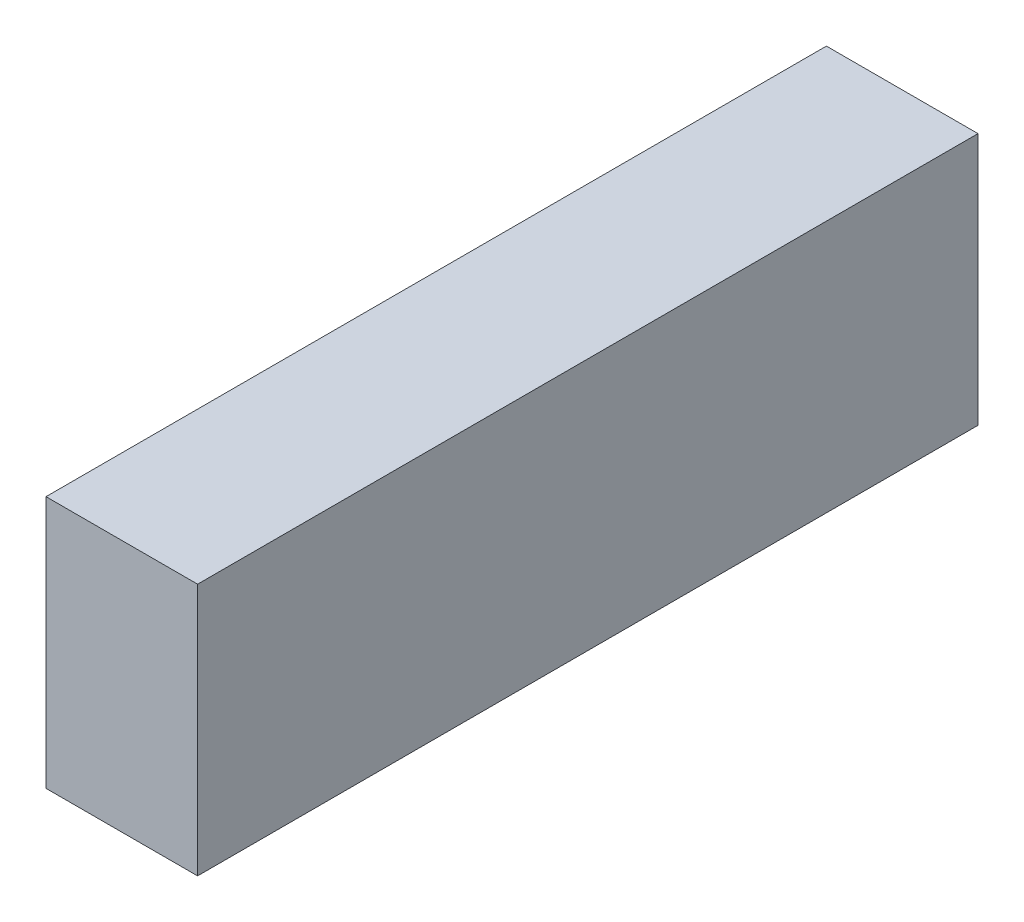
ISO-10303-21;
HEADER;
FILE_DESCRIPTION(('STEP AP214'),'2;1');
FILE_NAME('part.step','',(''),(''),'','','');
FILE_SCHEMA(('AUTOMOTIVE_DESIGN { 1 0 10303 214 1 1 1 1 }'));
ENDSEC;
DATA;
#1=APPLICATION_CONTEXT('core data for automotive mechanical design processes');
#2=APPLICATION_PROTOCOL_DEFINITION('international standard','automotive_design',2000,#1);
#3=PRODUCT_CONTEXT('',#1,'mechanical');
#4=PRODUCT('Part','Part','',(#3));
#5=PRODUCT_RELATED_PRODUCT_CATEGORY('part','',(#4));
#6=PRODUCT_DEFINITION_FORMATION('','',#4);
#7=PRODUCT_DEFINITION_CONTEXT('part definition',#1,'design');
#8=PRODUCT_DEFINITION('design','',#6,#7);
#9=PRODUCT_DEFINITION_SHAPE('','',#8);
#10=(LENGTH_UNIT() NAMED_UNIT(*) SI_UNIT(.MILLI.,.METRE.));
#11=(NAMED_UNIT(*) PLANE_ANGLE_UNIT() SI_UNIT($,.RADIAN.));
#12=(NAMED_UNIT(*) SI_UNIT($,.STERADIAN.) SOLID_ANGLE_UNIT());
#13=UNCERTAINTY_MEASURE_WITH_UNIT(LENGTH_MEASURE(1.E-05),#10,'distance_accuracy_value','');
#14=(GEOMETRIC_REPRESENTATION_CONTEXT(3) GLOBAL_UNCERTAINTY_ASSIGNED_CONTEXT((#13)) GLOBAL_UNIT_ASSIGNED_CONTEXT((#10,
#11,#12)) REPRESENTATION_CONTEXT('',''));
#15=CARTESIAN_POINT('',(0.,0.,0.));
#16=DIRECTION('',(0.,0.,1.));
#17=DIRECTION('',(1.,0.,0.));
#18=AXIS2_PLACEMENT_3D('',#15,#16,#17);
#19=CARTESIAN_POINT('',(-13.5,22.5,69.5));
#20=DIRECTION('',(1.,0.,0.));
#21=DIRECTION('',(0.,1.,0.));
#22=AXIS2_PLACEMENT_3D('',#19,#20,#21);
#23=PLANE('',#22);
#24=DIRECTION('',(0.,-1.,0.));
#25=VECTOR('',#24,1.);
#26=CARTESIAN_POINT('',(-13.5,22.5,-69.5));
#27=LINE('',#26,#25);
#28=CARTESIAN_POINT('',(-13.5,22.5,-69.5));
#29=VERTEX_POINT('',#28);
#30=CARTESIAN_POINT('',(-13.5,-22.5,-69.5));
#31=VERTEX_POINT('',#30);
#32=EDGE_CURVE('E97',#29,#31,#27,.T.);
#33=ORIENTED_EDGE('',*,*,#32,.T.);
#34=DIRECTION('',(0.,0.,-1.));
#35=VECTOR('',#34,1.);
#36=CARTESIAN_POINT('',(-13.5,-22.5,69.5));
#37=LINE('',#36,#35);
#38=CARTESIAN_POINT('',(-13.5,-22.5,69.5));
#39=VERTEX_POINT('',#38);
#40=EDGE_CURVE('E11',#39,#31,#37,.T.);
#41=ORIENTED_EDGE('',*,*,#40,.F.);
#42=DIRECTION('',(0.,-1.,0.));
#43=VECTOR('',#42,1.);
#44=CARTESIAN_POINT('',(-13.5,22.5,69.5));
#45=LINE('',#44,#43);
#46=CARTESIAN_POINT('',(-13.5,22.5,69.5));
#47=VERTEX_POINT('',#46);
#48=EDGE_CURVE('E85',#47,#39,#45,.T.);
#49=ORIENTED_EDGE('',*,*,#48,.F.);
#50=DIRECTION('',(0.,0.,-1.));
#51=VECTOR('',#50,1.);
#52=CARTESIAN_POINT('',(-13.5,22.5,69.5));
#53=LINE('',#52,#51);
#54=EDGE_CURVE('E93',#47,#29,#53,.T.);
#55=ORIENTED_EDGE('',*,*,#54,.T.);
#56=EDGE_LOOP('',(#33,#41,#49,#55));
#57=FACE_BOUND('',#56,.T.);
#58=ADVANCED_FACE('F34',(#57),#23,.F.);
#59=CARTESIAN_POINT('',(13.5,-22.5,69.5));
#60=DIRECTION('',(0.,1.,0.));
#61=DIRECTION('',(-1.,0.,0.));
#62=AXIS2_PLACEMENT_3D('',#59,#60,#61);
#63=PLANE('',#62);
#64=DIRECTION('',(1.,0.,0.));
#65=VECTOR('',#64,1.);
#66=CARTESIAN_POINT('',(13.5,-22.5,-69.5));
#67=LINE('',#66,#65);
#68=CARTESIAN_POINT('',(13.5,-22.5,-69.5));
#69=VERTEX_POINT('',#68);
#70=EDGE_CURVE('E89',#31,#69,#67,.T.);
#71=ORIENTED_EDGE('',*,*,#70,.T.);
#72=DIRECTION('',(0.,0.,-1.));
#73=VECTOR('',#72,1.);
#74=CARTESIAN_POINT('',(13.5,-22.5,69.5));
#75=LINE('',#74,#73);
#76=CARTESIAN_POINT('',(13.5,-22.5,69.5));
#77=VERTEX_POINT('',#76);
#78=EDGE_CURVE('E42',#77,#69,#75,.T.);
#79=ORIENTED_EDGE('',*,*,#78,.F.);
#80=DIRECTION('',(1.,0.,0.));
#81=VECTOR('',#80,1.);
#82=CARTESIAN_POINT('',(13.5,-22.5,69.5));
#83=LINE('',#82,#81);
#84=EDGE_CURVE('E80',#39,#77,#83,.T.);
#85=ORIENTED_EDGE('',*,*,#84,.F.);
#86=ORIENTED_EDGE('',*,*,#40,.T.);
#87=EDGE_LOOP('',(#71,#79,#85,#86));
#88=FACE_BOUND('',#87,.T.);
#89=ADVANCED_FACE('F88',(#88),#63,.F.);
#90=CARTESIAN_POINT('',(13.5,22.5,69.5));
#91=DIRECTION('',(-1.,0.,0.));
#92=DIRECTION('',(0.,-1.,0.));
#93=AXIS2_PLACEMENT_3D('',#90,#91,#92);
#94=PLANE('',#93);
#95=DIRECTION('',(0.,1.,0.));
#96=VECTOR('',#95,1.);
#97=CARTESIAN_POINT('',(13.5,22.5,-69.5));
#98=LINE('',#97,#96);
#99=CARTESIAN_POINT('',(13.5,22.5,-69.5));
#100=VERTEX_POINT('',#99);
#101=EDGE_CURVE('E67',#69,#100,#98,.T.);
#102=ORIENTED_EDGE('',*,*,#101,.T.);
#103=DIRECTION('',(0.,0.,-1.));
#104=VECTOR('',#103,1.);
#105=CARTESIAN_POINT('',(13.5,22.5,69.5));
#106=LINE('',#105,#104);
#107=CARTESIAN_POINT('',(13.5,22.5,69.5));
#108=VERTEX_POINT('',#107);
#109=EDGE_CURVE('E90',#108,#100,#106,.T.);
#110=ORIENTED_EDGE('',*,*,#109,.F.);
#111=DIRECTION('',(0.,1.,0.));
#112=VECTOR('',#111,1.);
#113=CARTESIAN_POINT('',(13.5,22.5,69.5));
#114=LINE('',#113,#112);
#115=EDGE_CURVE('E83',#77,#108,#114,.T.);
#116=ORIENTED_EDGE('',*,*,#115,.F.);
#117=ORIENTED_EDGE('',*,*,#78,.T.);
#118=EDGE_LOOP('',(#102,#110,#116,#117));
#119=FACE_BOUND('',#118,.T.);
#120=ADVANCED_FACE('F91',(#119),#94,.F.);
#121=CARTESIAN_POINT('',(13.5,22.5,69.5));
#122=DIRECTION('',(0.,-1.,0.));
#123=DIRECTION('',(1.,0.,0.));
#124=AXIS2_PLACEMENT_3D('',#121,#122,#123);
#125=PLANE('',#124);
#126=DIRECTION('',(-1.,0.,0.));
#127=VECTOR('',#126,1.);
#128=CARTESIAN_POINT('',(13.5,22.5,-69.5));
#129=LINE('',#128,#127);
#130=EDGE_CURVE('E73',#100,#29,#129,.T.);
#131=ORIENTED_EDGE('',*,*,#130,.T.);
#132=ORIENTED_EDGE('',*,*,#54,.F.);
#133=DIRECTION('',(-1.,0.,0.));
#134=VECTOR('',#133,1.);
#135=CARTESIAN_POINT('',(13.5,22.5,69.5));
#136=LINE('',#135,#134);
#137=EDGE_CURVE('E50',#108,#47,#136,.T.);
#138=ORIENTED_EDGE('',*,*,#137,.F.);
#139=ORIENTED_EDGE('',*,*,#109,.T.);
#140=EDGE_LOOP('',(#131,#132,#138,#139));
#141=FACE_BOUND('',#140,.T.);
#142=ADVANCED_FACE('F104',(#141),#125,.F.);
#143=CARTESIAN_POINT('',(0.,0.,69.5));
#144=DIRECTION('',(0.,0.,-1.));
#145=DIRECTION('',(-1.,0.,0.));
#146=AXIS2_PLACEMENT_3D('',#143,#144,#145);
#147=PLANE('',#146);
#148=ORIENTED_EDGE('',*,*,#48,.T.);
#149=ORIENTED_EDGE('',*,*,#84,.T.);
#150=ORIENTED_EDGE('',*,*,#115,.T.);
#151=ORIENTED_EDGE('',*,*,#137,.T.);
#152=EDGE_LOOP('',(#148,#149,#150,#151));
#153=FACE_BOUND('',#152,.T.);
#154=ADVANCED_FACE('F81',(#153),#147,.F.);
#155=CARTESIAN_POINT('',(0.,0.,-69.5));
#156=DIRECTION('',(0.,0.,-1.));
#157=DIRECTION('',(-1.,0.,0.));
#158=AXIS2_PLACEMENT_3D('',#155,#156,#157);
#159=PLANE('',#158);
#160=ORIENTED_EDGE('',*,*,#32,.F.);
#161=ORIENTED_EDGE('',*,*,#130,.F.);
#162=ORIENTED_EDGE('',*,*,#101,.F.);
#163=ORIENTED_EDGE('',*,*,#70,.F.);
#164=EDGE_LOOP('',(#160,#161,#162,#163));
#165=FACE_BOUND('',#164,.T.);
#166=ADVANCED_FACE('F107',(#165),#159,.T.);
#167=CLOSED_SHELL('',(#58,#89,#120,#142,#154,#166));
#168=MANIFOLD_SOLID_BREP('B2',#167);
#169=ADVANCED_BREP_SHAPE_REPRESENTATION('',(#18,#168),#14);
#170=SHAPE_DEFINITION_REPRESENTATION(#9,#169);
ENDSEC;
END-ISO-10303-21;
